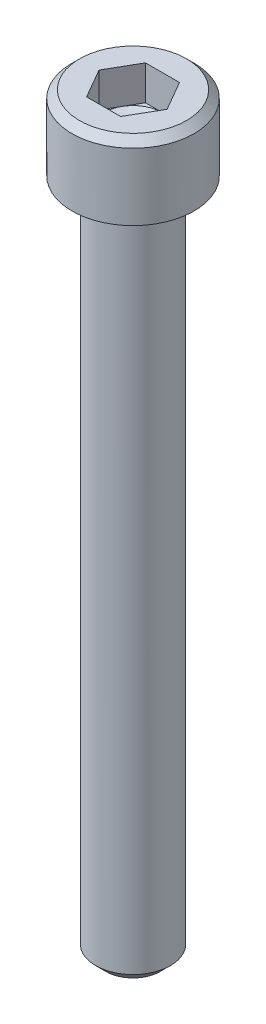
ISO-10303-21;
HEADER;
FILE_DESCRIPTION(('STEP AP214'),'2;1');
FILE_NAME('part.step','',(''),(''),'','','');
FILE_SCHEMA(('AUTOMOTIVE_DESIGN { 1 0 10303 214 1 1 1 1 }'));
ENDSEC;
DATA;
#1=APPLICATION_CONTEXT('core data for automotive mechanical design processes');
#2=APPLICATION_PROTOCOL_DEFINITION('international standard','automotive_design',2000,#1);
#3=PRODUCT_CONTEXT('',#1,'mechanical');
#4=PRODUCT('Part','Part','',(#3));
#5=PRODUCT_RELATED_PRODUCT_CATEGORY('part','',(#4));
#6=PRODUCT_DEFINITION_FORMATION('','',#4);
#7=PRODUCT_DEFINITION_CONTEXT('part definition',#1,'design');
#8=PRODUCT_DEFINITION('design','',#6,#7);
#9=PRODUCT_DEFINITION_SHAPE('','',#8);
#10=(LENGTH_UNIT() NAMED_UNIT(*) SI_UNIT(.MILLI.,.METRE.));
#11=(NAMED_UNIT(*) PLANE_ANGLE_UNIT() SI_UNIT($,.RADIAN.));
#12=(NAMED_UNIT(*) SI_UNIT($,.STERADIAN.) SOLID_ANGLE_UNIT());
#13=UNCERTAINTY_MEASURE_WITH_UNIT(LENGTH_MEASURE(1.E-05),#10,'distance_accuracy_value','');
#14=(GEOMETRIC_REPRESENTATION_CONTEXT(3) GLOBAL_UNCERTAINTY_ASSIGNED_CONTEXT((#13)) GLOBAL_UNIT_ASSIGNED_CONTEXT((#10,
#11,#12)) REPRESENTATION_CONTEXT('',''));
#15=CARTESIAN_POINT('',(0.,0.,0.));
#16=DIRECTION('',(0.,0.,1.));
#17=DIRECTION('',(1.,0.,0.));
#18=AXIS2_PLACEMENT_3D('',#15,#16,#17);
#19=CARTESIAN_POINT('',(0.,1.87959999988152,0.));
#20=DIRECTION('',(0.,1.,0.));
#21=DIRECTION('',(0.,0.,1.));
#22=AXIS2_PLACEMENT_3D('',#19,#20,#21);
#23=CONICAL_SURFACE('',#22,1.38429999981327,1.04719755105418);
#24=CARTESIAN_POINT('',(0.,1.08037402230821,-1.70530256582424E-10));
#25=VERTEX_POINT('',#24);
#26=VERTEX_LOOP('',#25);
#27=FACE_BOUND('',#26,.T.);
#28=CARTESIAN_POINT('',(0.,1.87959999997998,0.));
#29=DIRECTION('',(0.,1.,0.));
#30=DIRECTION('',(0.,0.,1.));
#31=AXIS2_PLACEMENT_3D('',#28,#29,#30);
#32=CIRCLE('',#31,1.3842999999838);
#33=CARTESIAN_POINT('',(-1.19883896645178,1.87959999998999,-0.692149999995953));
#34=VERTEX_POINT('',#33);
#35=CARTESIAN_POINT('',(0.,1.87959999998999,-1.3842999999919));
#36=VERTEX_POINT('',#35);
#37=EDGE_CURVE('E148',#34,#36,#32,.F.);
#38=ORIENTED_EDGE('',*,*,#37,.F.);
#39=CARTESIAN_POINT('',(0.,1.87959999997998,0.));
#40=DIRECTION('',(0.,1.,0.));
#41=DIRECTION('',(0.,0.,1.));
#42=AXIS2_PLACEMENT_3D('',#39,#40,#41);
#43=CIRCLE('',#42,1.3842999999838);
#44=CARTESIAN_POINT('',(-1.19883896645178,1.87959999998999,0.692149999995946));
#45=VERTEX_POINT('',#44);
#46=EDGE_CURVE('E95',#45,#34,#43,.F.);
#47=ORIENTED_EDGE('',*,*,#46,.F.);
#48=CARTESIAN_POINT('',(0.,1.87959999997998,0.));
#49=DIRECTION('',(0.,1.,0.));
#50=DIRECTION('',(0.,0.,1.));
#51=AXIS2_PLACEMENT_3D('',#48,#49,#50);
#52=CIRCLE('',#51,1.3842999999838);
#53=CARTESIAN_POINT('',(0.,1.87959999998999,1.3842999999919));
#54=VERTEX_POINT('',#53);
#55=EDGE_CURVE('E91',#54,#45,#52,.F.);
#56=ORIENTED_EDGE('',*,*,#55,.F.);
#57=CARTESIAN_POINT('',(0.,1.87959999997998,0.));
#58=DIRECTION('',(0.,1.,0.));
#59=DIRECTION('',(0.,0.,1.));
#60=AXIS2_PLACEMENT_3D('',#57,#58,#59);
#61=CIRCLE('',#60,1.3842999999838);
#62=CARTESIAN_POINT('',(1.19883896645178,1.87959999998999,0.692149999995948));
#63=VERTEX_POINT('',#62);
#64=EDGE_CURVE('E89',#63,#54,#61,.F.);
#65=ORIENTED_EDGE('',*,*,#64,.F.);
#66=CARTESIAN_POINT('',(0.,1.87959999997998,0.));
#67=DIRECTION('',(0.,1.,0.));
#68=DIRECTION('',(0.,0.,1.));
#69=AXIS2_PLACEMENT_3D('',#66,#67,#68);
#70=CIRCLE('',#69,1.3842999999838);
#71=CARTESIAN_POINT('',(1.19883896645178,1.87959999998999,-0.692149999995947));
#72=VERTEX_POINT('',#71);
#73=EDGE_CURVE('E19',#72,#63,#70,.F.);
#74=ORIENTED_EDGE('',*,*,#73,.F.);
#75=CARTESIAN_POINT('',(0.,1.87959999997998,0.));
#76=DIRECTION('',(0.,1.,0.));
#77=DIRECTION('',(0.,0.,1.));
#78=AXIS2_PLACEMENT_3D('',#75,#76,#77);
#79=CIRCLE('',#78,1.3842999999838);
#80=EDGE_CURVE('E106',#36,#72,#79,.F.);
#81=ORIENTED_EDGE('',*,*,#80,.F.);
#82=EDGE_LOOP('',(#38,#47,#56,#65,#74,#81));
#83=FACE_BOUND('',#82,.T.);
#84=ADVANCED_FACE('F16',(#27,#83),#23,.F.);
#85=CARTESIAN_POINT('',(0.,1.8796,0.));
#86=DIRECTION('',(0.,1.,0.));
#87=DIRECTION('',(0.,0.,1.));
#88=AXIS2_PLACEMENT_3D('',#85,#86,#87);
#89=PLANE('',#88);
#90=DIRECTION('',(0.500000000000001,0.,-0.866025403784438));
#91=VECTOR('',#90,1.);
#92=CARTESIAN_POINT('',(0.799225977639198,1.8796,1.3843));
#93=LINE('',#92,#91);
#94=CARTESIAN_POINT('',(1.5984519552784,1.8796,0.));
#95=VERTEX_POINT('',#94);
#96=EDGE_CURVE('E101',#63,#95,#93,.T.);
#97=ORIENTED_EDGE('',*,*,#96,.T.);
#98=DIRECTION('',(-0.499999999999999,0.,-0.866025403784439));
#99=VECTOR('',#98,1.);
#100=CARTESIAN_POINT('',(1.5984519552784,1.8796,0.));
#101=LINE('',#100,#99);
#102=EDGE_CURVE('E104',#95,#72,#101,.T.);
#103=ORIENTED_EDGE('',*,*,#102,.T.);
#104=ORIENTED_EDGE('',*,*,#73,.T.);
#105=EDGE_LOOP('',(#97,#103,#104));
#106=FACE_BOUND('',#105,.T.);
#107=ADVANCED_FACE('F99',(#106),#89,.T.);
#108=CARTESIAN_POINT('',(0.,1.8796,0.));
#109=DIRECTION('',(0.,1.,0.));
#110=DIRECTION('',(0.,0.,1.));
#111=AXIS2_PLACEMENT_3D('',#108,#109,#110);
#112=PLANE('',#111);
#113=DIRECTION('',(-0.499999999999999,0.,-0.866025403784439));
#114=VECTOR('',#113,1.);
#115=CARTESIAN_POINT('',(1.5984519552784,1.8796,0.));
#116=LINE('',#115,#114);
#117=CARTESIAN_POINT('',(0.799225977639201,1.8796,-1.3843));
#118=VERTEX_POINT('',#117);
#119=EDGE_CURVE('E115',#72,#118,#116,.T.);
#120=ORIENTED_EDGE('',*,*,#119,.T.);
#121=DIRECTION('',(-1.,0.,0.));
#122=VECTOR('',#121,1.);
#123=CARTESIAN_POINT('',(0.799225977639201,1.8796,-1.3843));
#124=LINE('',#123,#122);
#125=EDGE_CURVE('E155',#118,#36,#124,.T.);
#126=ORIENTED_EDGE('',*,*,#125,.T.);
#127=ORIENTED_EDGE('',*,*,#80,.T.);
#128=EDGE_LOOP('',(#120,#126,#127));
#129=FACE_BOUND('',#128,.T.);
#130=ADVANCED_FACE('F152',(#129),#112,.T.);
#131=CARTESIAN_POINT('',(0.,1.8796,0.));
#132=DIRECTION('',(0.,1.,0.));
#133=DIRECTION('',(0.,0.,1.));
#134=AXIS2_PLACEMENT_3D('',#131,#132,#133);
#135=PLANE('',#134);
#136=DIRECTION('',(-1.,0.,0.));
#137=VECTOR('',#136,1.);
#138=CARTESIAN_POINT('',(0.799225977639201,1.8796,-1.3843));
#139=LINE('',#138,#137);
#140=CARTESIAN_POINT('',(-0.799225977639195,1.8796,-1.3843));
#141=VERTEX_POINT('',#140);
#142=EDGE_CURVE('E160',#36,#141,#139,.T.);
#143=ORIENTED_EDGE('',*,*,#142,.T.);
#144=DIRECTION('',(-0.5,0.,0.866025403784438));
#145=VECTOR('',#144,1.);
#146=CARTESIAN_POINT('',(-0.799225977639195,1.8796,-1.3843));
#147=LINE('',#146,#145);
#148=EDGE_CURVE('E163',#141,#34,#147,.T.);
#149=ORIENTED_EDGE('',*,*,#148,.T.);
#150=ORIENTED_EDGE('',*,*,#37,.T.);
#151=EDGE_LOOP('',(#143,#149,#150));
#152=FACE_BOUND('',#151,.T.);
#153=ADVANCED_FACE('F159',(#152),#135,.T.);
#154=CARTESIAN_POINT('',(0.,1.8796,0.));
#155=DIRECTION('',(0.,1.,0.));
#156=DIRECTION('',(0.,0.,1.));
#157=AXIS2_PLACEMENT_3D('',#154,#155,#156);
#158=PLANE('',#157);
#159=DIRECTION('',(-0.5,0.,0.866025403784438));
#160=VECTOR('',#159,1.);
#161=CARTESIAN_POINT('',(-0.799225977639195,1.8796,-1.3843));
#162=LINE('',#161,#160);
#163=CARTESIAN_POINT('',(-1.5984519552784,1.8796,0.));
#164=VERTEX_POINT('',#163);
#165=EDGE_CURVE('E171',#34,#164,#162,.T.);
#166=ORIENTED_EDGE('',*,*,#165,.T.);
#167=DIRECTION('',(0.5,0.,0.866025403784439));
#168=VECTOR('',#167,1.);
#169=CARTESIAN_POINT('',(-1.5984519552784,1.8796,0.));
#170=LINE('',#169,#168);
#171=EDGE_CURVE('E230',#164,#45,#170,.T.);
#172=ORIENTED_EDGE('',*,*,#171,.T.);
#173=ORIENTED_EDGE('',*,*,#46,.T.);
#174=EDGE_LOOP('',(#166,#172,#173));
#175=FACE_BOUND('',#174,.T.);
#176=ADVANCED_FACE('F335',(#175),#158,.T.);
#177=CARTESIAN_POINT('',(0.,1.8796,0.));
#178=DIRECTION('',(0.,1.,0.));
#179=DIRECTION('',(0.,0.,1.));
#180=AXIS2_PLACEMENT_3D('',#177,#178,#179);
#181=PLANE('',#180);
#182=DIRECTION('',(1.,0.,0.));
#183=VECTOR('',#182,1.);
#184=CARTESIAN_POINT('',(-0.799225977639198,1.8796,1.3843));
#185=LINE('',#184,#183);
#186=CARTESIAN_POINT('',(0.799225977639198,1.8796,1.3843));
#187=VERTEX_POINT('',#186);
#188=EDGE_CURVE('E111',#54,#187,#185,.T.);
#189=ORIENTED_EDGE('',*,*,#188,.T.);
#190=DIRECTION('',(0.500000000000001,0.,-0.866025403784438));
#191=VECTOR('',#190,1.);
#192=CARTESIAN_POINT('',(0.799225977639198,1.8796,1.3843));
#193=LINE('',#192,#191);
#194=EDGE_CURVE('E108',#187,#63,#193,.T.);
#195=ORIENTED_EDGE('',*,*,#194,.T.);
#196=ORIENTED_EDGE('',*,*,#64,.T.);
#197=EDGE_LOOP('',(#189,#195,#196));
#198=FACE_BOUND('',#197,.T.);
#199=ADVANCED_FACE('F109',(#198),#181,.T.);
#200=CARTESIAN_POINT('',(0.,1.8796,0.));
#201=DIRECTION('',(0.,1.,0.));
#202=DIRECTION('',(0.,0.,1.));
#203=AXIS2_PLACEMENT_3D('',#200,#201,#202);
#204=PLANE('',#203);
#205=DIRECTION('',(0.5,0.,0.866025403784439));
#206=VECTOR('',#205,1.);
#207=CARTESIAN_POINT('',(-1.5984519552784,1.8796,0.));
#208=LINE('',#207,#206);
#209=CARTESIAN_POINT('',(-0.799225977639199,1.8796,1.3843));
#210=VERTEX_POINT('',#209);
#211=EDGE_CURVE('E167',#45,#210,#208,.T.);
#212=ORIENTED_EDGE('',*,*,#211,.T.);
#213=DIRECTION('',(1.,0.,0.));
#214=VECTOR('',#213,1.);
#215=CARTESIAN_POINT('',(-0.799225977639198,1.8796,1.3843));
#216=LINE('',#215,#214);
#217=EDGE_CURVE('E131',#210,#54,#216,.T.);
#218=ORIENTED_EDGE('',*,*,#217,.T.);
#219=ORIENTED_EDGE('',*,*,#55,.T.);
#220=EDGE_LOOP('',(#212,#218,#219));
#221=FACE_BOUND('',#220,.T.);
#222=ADVANCED_FACE('F329',(#221),#204,.T.);
#223=CARTESIAN_POINT('',(0.799225977639198,3.5052,1.3843));
#224=DIRECTION('',(0.866025403784438,0.,0.500000000000001));
#225=DIRECTION('',(0.500000000000001,0.,-0.866025403784438));
#226=AXIS2_PLACEMENT_3D('',#223,#224,#225);
#227=PLANE('',#226);
#228=DIRECTION('',(0.,1.,0.));
#229=VECTOR('',#228,1.);
#230=CARTESIAN_POINT('',(0.799225977639198,3.5052,1.3843));
#231=LINE('',#230,#229);
#232=CARTESIAN_POINT('',(0.799225977639198,3.5052,1.3843));
#233=VERTEX_POINT('',#232);
#234=EDGE_CURVE('E238',#187,#233,#231,.T.);
#235=ORIENTED_EDGE('',*,*,#234,.T.);
#236=DIRECTION('',(0.500000000000002,0.,-0.866025403784437));
#237=VECTOR('',#236,1.);
#238=CARTESIAN_POINT('',(0.799225977639198,3.5052,1.3843));
#239=LINE('',#238,#237);
#240=CARTESIAN_POINT('',(1.5984519552784,3.5052,0.));
#241=VERTEX_POINT('',#240);
#242=EDGE_CURVE('E128',#233,#241,#239,.T.);
#243=ORIENTED_EDGE('',*,*,#242,.T.);
#244=DIRECTION('',(0.,1.,0.));
#245=VECTOR('',#244,1.);
#246=CARTESIAN_POINT('',(1.5984519552784,3.5052,0.));
#247=LINE('',#246,#245);
#248=EDGE_CURVE('E119',#241,#95,#247,.F.);
#249=ORIENTED_EDGE('',*,*,#248,.T.);
#250=ORIENTED_EDGE('',*,*,#96,.F.);
#251=ORIENTED_EDGE('',*,*,#194,.F.);
#252=EDGE_LOOP('',(#235,#243,#249,#250,#251));
#253=FACE_BOUND('',#252,.T.);
#254=ADVANCED_FACE('F117',(#253),#227,.F.);
#255=CARTESIAN_POINT('',(1.5984519552784,3.5052,0.));
#256=DIRECTION('',(0.866025403784439,0.,-0.499999999999999));
#257=DIRECTION('',(-0.499999999999999,0.,-0.866025403784439));
#258=AXIS2_PLACEMENT_3D('',#255,#256,#257);
#259=PLANE('',#258);
#260=ORIENTED_EDGE('',*,*,#248,.F.);
#261=DIRECTION('',(-0.5,0.,-0.866025403784439));
#262=VECTOR('',#261,1.);
#263=CARTESIAN_POINT('',(1.5984519552784,3.5052,0.));
#264=LINE('',#263,#262);
#265=CARTESIAN_POINT('',(0.799225977639201,3.5052,-1.3843));
#266=VERTEX_POINT('',#265);
#267=EDGE_CURVE('E130',#241,#266,#264,.T.);
#268=ORIENTED_EDGE('',*,*,#267,.T.);
#269=DIRECTION('',(0.,1.,0.));
#270=VECTOR('',#269,1.);
#271=CARTESIAN_POINT('',(0.799225977639201,3.5052,-1.3843));
#272=LINE('',#271,#270);
#273=EDGE_CURVE('E179',#266,#118,#272,.F.);
#274=ORIENTED_EDGE('',*,*,#273,.T.);
#275=ORIENTED_EDGE('',*,*,#119,.F.);
#276=ORIENTED_EDGE('',*,*,#102,.F.);
#277=EDGE_LOOP('',(#260,#268,#274,#275,#276));
#278=FACE_BOUND('',#277,.T.);
#279=ADVANCED_FACE('F218',(#278),#259,.F.);
#280=CARTESIAN_POINT('',(0.799225977639201,3.5052,-1.3843));
#281=DIRECTION('',(0.,0.,-1.));
#282=DIRECTION('',(-1.,0.,0.));
#283=AXIS2_PLACEMENT_3D('',#280,#281,#282);
#284=PLANE('',#283);
#285=ORIENTED_EDGE('',*,*,#273,.F.);
#286=DIRECTION('',(1.,0.,0.));
#287=VECTOR('',#286,1.);
#288=CARTESIAN_POINT('',(0.,3.5052,-1.3843));
#289=LINE('',#288,#287);
#290=CARTESIAN_POINT('',(-0.799225977639195,3.5052,-1.3843));
#291=VERTEX_POINT('',#290);
#292=EDGE_CURVE('E189',#266,#291,#289,.F.);
#293=ORIENTED_EDGE('',*,*,#292,.T.);
#294=DIRECTION('',(0.,1.,0.));
#295=VECTOR('',#294,1.);
#296=CARTESIAN_POINT('',(-0.799225977639195,3.5052,-1.3843));
#297=LINE('',#296,#295);
#298=EDGE_CURVE('E168',#291,#141,#297,.F.);
#299=ORIENTED_EDGE('',*,*,#298,.T.);
#300=ORIENTED_EDGE('',*,*,#142,.F.);
#301=ORIENTED_EDGE('',*,*,#125,.F.);
#302=EDGE_LOOP('',(#285,#293,#299,#300,#301));
#303=FACE_BOUND('',#302,.T.);
#304=ADVANCED_FACE('F223',(#303),#284,.F.);
#305=CARTESIAN_POINT('',(-0.799225977639195,3.5052,-1.3843));
#306=DIRECTION('',(-0.866025403784438,0.,-0.5));
#307=DIRECTION('',(-0.5,0.,0.866025403784438));
#308=AXIS2_PLACEMENT_3D('',#305,#306,#307);
#309=PLANE('',#308);
#310=ORIENTED_EDGE('',*,*,#298,.F.);
#311=DIRECTION('',(-0.500000000000003,0.,0.866025403784437));
#312=VECTOR('',#311,1.);
#313=CARTESIAN_POINT('',(-0.799225977639195,3.5052,-1.3843));
#314=LINE('',#313,#312);
#315=CARTESIAN_POINT('',(-1.5984519552784,3.5052,0.));
#316=VERTEX_POINT('',#315);
#317=EDGE_CURVE('E187',#291,#316,#314,.T.);
#318=ORIENTED_EDGE('',*,*,#317,.T.);
#319=DIRECTION('',(0.,1.,0.));
#320=VECTOR('',#319,1.);
#321=CARTESIAN_POINT('',(-1.5984519552784,3.5052,0.));
#322=LINE('',#321,#320);
#323=EDGE_CURVE('E173',#316,#164,#322,.F.);
#324=ORIENTED_EDGE('',*,*,#323,.T.);
#325=ORIENTED_EDGE('',*,*,#165,.F.);
#326=ORIENTED_EDGE('',*,*,#148,.F.);
#327=EDGE_LOOP('',(#310,#318,#324,#325,#326));
#328=FACE_BOUND('',#327,.T.);
#329=ADVANCED_FACE('F172',(#328),#309,.F.);
#330=CARTESIAN_POINT('',(-1.5984519552784,3.5052,0.));
#331=DIRECTION('',(-0.866025403784439,0.,0.5));
#332=DIRECTION('',(0.5,0.,0.866025403784439));
#333=AXIS2_PLACEMENT_3D('',#330,#331,#332);
#334=PLANE('',#333);
#335=ORIENTED_EDGE('',*,*,#323,.F.);
#336=DIRECTION('',(0.500000000000001,0.,0.866025403784438));
#337=VECTOR('',#336,1.);
#338=CARTESIAN_POINT('',(-1.5984519552784,3.5052,0.));
#339=LINE('',#338,#337);
#340=CARTESIAN_POINT('',(-0.799225977639198,3.5052,1.3843));
#341=VERTEX_POINT('',#340);
#342=EDGE_CURVE('E34',#316,#341,#339,.T.);
#343=ORIENTED_EDGE('',*,*,#342,.T.);
#344=DIRECTION('',(0.,1.,0.));
#345=VECTOR('',#344,1.);
#346=CARTESIAN_POINT('',(-0.799225977639198,3.5052,1.3843));
#347=LINE('',#346,#345);
#348=EDGE_CURVE('E240',#341,#210,#347,.F.);
#349=ORIENTED_EDGE('',*,*,#348,.T.);
#350=ORIENTED_EDGE('',*,*,#211,.F.);
#351=ORIENTED_EDGE('',*,*,#171,.F.);
#352=EDGE_LOOP('',(#335,#343,#349,#350,#351));
#353=FACE_BOUND('',#352,.T.);
#354=ADVANCED_FACE('F228',(#353),#334,.F.);
#355=CARTESIAN_POINT('',(-0.799225977639198,3.5052,1.3843));
#356=DIRECTION('',(0.,0.,1.));
#357=DIRECTION('',(1.,0.,0.));
#358=AXIS2_PLACEMENT_3D('',#355,#356,#357);
#359=PLANE('',#358);
#360=ORIENTED_EDGE('',*,*,#348,.F.);
#361=DIRECTION('',(1.,0.,0.));
#362=VECTOR('',#361,1.);
#363=CARTESIAN_POINT('',(0.,3.5052,1.3843));
#364=LINE('',#363,#362);
#365=EDGE_CURVE('E144',#341,#233,#364,.T.);
#366=ORIENTED_EDGE('',*,*,#365,.T.);
#367=ORIENTED_EDGE('',*,*,#234,.F.);
#368=ORIENTED_EDGE('',*,*,#188,.F.);
#369=ORIENTED_EDGE('',*,*,#217,.F.);
#370=EDGE_LOOP('',(#360,#366,#367,#368,#369));
#371=FACE_BOUND('',#370,.T.);
#372=ADVANCED_FACE('F315',(#371),#359,.F.);
#373=CARTESIAN_POINT('',(0.,3.5052,0.));
#374=DIRECTION('',(0.,-1.,0.));
#375=DIRECTION('',(0.,0.,-1.));
#376=AXIS2_PLACEMENT_3D('',#373,#374,#375);
#377=PLANE('',#376);
#378=ORIENTED_EDGE('',*,*,#342,.F.);
#379=ORIENTED_EDGE('',*,*,#317,.F.);
#380=ORIENTED_EDGE('',*,*,#292,.F.);
#381=ORIENTED_EDGE('',*,*,#267,.F.);
#382=ORIENTED_EDGE('',*,*,#242,.F.);
#383=ORIENTED_EDGE('',*,*,#365,.F.);
#384=EDGE_LOOP('',(#378,#379,#380,#381,#382,#383));
#385=FACE_BOUND('',#384,.T.);
#386=CARTESIAN_POINT('',(0.,3.50519999989274,0.));
#387=DIRECTION('',(0.,-1.,0.));
#388=DIRECTION('',(1.,0.,0.));
#389=AXIS2_PLACEMENT_3D('',#386,#387,#388);
#390=CIRCLE('',#389,2.51460000004045);
#391=CARTESIAN_POINT('',(2.51460000004045,3.50519999989274,0.));
#392=VERTEX_POINT('',#391);
#393=EDGE_CURVE('E142',#392,#392,#390,.T.);
#394=ORIENTED_EDGE('',*,*,#393,.F.);
#395=EDGE_LOOP('',(#394));
#396=FACE_BOUND('',#395,.T.);
#397=ADVANCED_FACE('F225',(#385,#396),#377,.F.);
#398=CARTESIAN_POINT('',(0.,3.149599999972,0.));
#399=DIRECTION('',(0.,-1.,0.));
#400=DIRECTION('',(1.,0.,0.));
#401=AXIS2_PLACEMENT_3D('',#398,#399,#400);
#402=CONICAL_SURFACE('',#401,2.87020000001803,0.785398163477374);
#403=CARTESIAN_POINT('',(0.,3.1496,0.));
#404=DIRECTION('',(0.,-1.,0.));
#405=DIRECTION('',(0.,0.,-1.));
#406=AXIS2_PLACEMENT_3D('',#403,#404,#405);
#407=CIRCLE('',#406,2.8702);
#408=CARTESIAN_POINT('',(0.,3.1496,-2.8702));
#409=VERTEX_POINT('',#408);
#410=EDGE_CURVE('E141',#409,#409,#407,.T.);
#411=ORIENTED_EDGE('',*,*,#410,.F.);
#412=EDGE_LOOP('',(#411));
#413=FACE_BOUND('',#412,.T.);
#414=ORIENTED_EDGE('',*,*,#393,.T.);
#415=EDGE_LOOP('',(#414));
#416=FACE_BOUND('',#415,.T.);
#417=ADVANCED_FACE('F308',(#413,#416),#402,.T.);
#418=CARTESIAN_POINT('',(0.,5.26796,0.));
#419=DIRECTION('',(0.,-1.,0.));
#420=DIRECTION('',(0.,0.,-1.));
#421=AXIS2_PLACEMENT_3D('',#418,#419,#420);
#422=CYLINDRICAL_SURFACE('',#421,2.8702);
#423=CARTESIAN_POINT('',(0.,0.,0.));
#424=DIRECTION('',(0.,-1.,0.));
#425=DIRECTION('',(0.,0.,-1.));
#426=AXIS2_PLACEMENT_3D('',#423,#424,#425);
#427=CIRCLE('',#426,2.8702);
#428=CARTESIAN_POINT('',(0.,0.,-2.8702));
#429=VERTEX_POINT('',#428);
#430=EDGE_CURVE('E138',#429,#429,#427,.T.);
#431=ORIENTED_EDGE('',*,*,#430,.F.);
#432=EDGE_LOOP('',(#431));
#433=FACE_BOUND('',#432,.T.);
#434=ORIENTED_EDGE('',*,*,#410,.T.);
#435=EDGE_LOOP('',(#434));
#436=FACE_BOUND('',#435,.T.);
#437=ADVANCED_FACE('F305',(#433,#436),#422,.T.);
#438=CARTESIAN_POINT('',(0.,0.,0.));
#439=DIRECTION('',(0.,-1.,0.));
#440=DIRECTION('',(0.,0.,-1.));
#441=AXIS2_PLACEMENT_3D('',#438,#439,#440);
#442=PLANE('',#441);
#443=CARTESIAN_POINT('',(0.,0.,0.));
#444=DIRECTION('',(0.,-1.,0.));
#445=DIRECTION('',(-1.,0.,-2.63360828039282E-11));
#446=AXIS2_PLACEMENT_3D('',#443,#444,#445);
#447=CIRCLE('',#446,2.0066);
#448=CARTESIAN_POINT('',(-2.0066,0.,-5.28459837543624E-11));
#449=VERTEX_POINT('',#448);
#450=EDGE_CURVE('E137',#449,#449,#447,.F.);
#451=ORIENTED_EDGE('',*,*,#450,.T.);
#452=EDGE_LOOP('',(#451));
#453=FACE_BOUND('',#452,.T.);
#454=ORIENTED_EDGE('',*,*,#430,.T.);
#455=EDGE_LOOP('',(#454));
#456=FACE_BOUND('',#455,.T.);
#457=ADVANCED_FACE('F296',(#453,#456),#442,.T.);
#458=CARTESIAN_POINT('',(0.,-31.75,0.));
#459=DIRECTION('',(0.,-1.,0.));
#460=DIRECTION('',(0.,0.,-1.));
#461=AXIS2_PLACEMENT_3D('',#458,#459,#460);
#462=PLANE('',#461);
#463=CARTESIAN_POINT('',(0.,-31.7499999999313,0.));
#464=DIRECTION('',(0.,1.,0.));
#465=DIRECTION('',(0.,0.,1.));
#466=AXIS2_PLACEMENT_3D('',#463,#464,#465);
#467=CIRCLE('',#466,1.28015999996478);
#468=CARTESIAN_POINT('',(0.,-31.7499999999313,1.28015999996478));
#469=VERTEX_POINT('',#468);
#470=EDGE_CURVE('E134',#469,#469,#467,.T.);
#471=ORIENTED_EDGE('',*,*,#470,.F.);
#472=EDGE_LOOP('',(#471));
#473=FACE_BOUND('',#472,.T.);
#474=ADVANCED_FACE('F283',(#473),#462,.T.);
#475=CARTESIAN_POINT('',(0.,-0.254,0.));
#476=DIRECTION('',(0.,-1.,0.));
#477=DIRECTION('',(0.,0.,-1.));
#478=AXIS2_PLACEMENT_3D('',#475,#476,#477);
#479=TOROIDAL_SURFACE('',#478,2.0066,0.254);
#480=CARTESIAN_POINT('',(0.,-0.254,0.));
#481=DIRECTION('',(0.,-1.,0.));
#482=DIRECTION('',(0.,0.,-1.));
#483=AXIS2_PLACEMENT_3D('',#480,#481,#482);
#484=CIRCLE('',#483,1.7526);
#485=CARTESIAN_POINT('',(0.,-0.254,-1.7526));
#486=VERTEX_POINT('',#485);
#487=EDGE_CURVE('E25',#486,#486,#484,.T.);
#488=ORIENTED_EDGE('',*,*,#487,.F.);
#489=EDGE_LOOP('',(#488));
#490=FACE_BOUND('',#489,.T.);
#491=ORIENTED_EDGE('',*,*,#450,.F.);
#492=EDGE_LOOP('',(#491));
#493=FACE_BOUND('',#492,.T.);
#494=ADVANCED_FACE('F271',(#490,#493),#479,.F.);
#495=CARTESIAN_POINT('',(0.,-31.2775599999782,0.));
#496=DIRECTION('',(0.,1.,0.));
#497=DIRECTION('',(0.,0.,1.));
#498=AXIS2_PLACEMENT_3D('',#495,#496,#497);
#499=CONICAL_SURFACE('',#498,1.75259999991795,0.785398163397448);
#500=ORIENTED_EDGE('',*,*,#470,.T.);
#501=EDGE_LOOP('',(#500));
#502=FACE_BOUND('',#501,.T.);
#503=CARTESIAN_POINT('',(0.,-31.27756,0.));
#504=DIRECTION('',(0.,-1.,0.));
#505=DIRECTION('',(0.,0.,-1.));
#506=AXIS2_PLACEMENT_3D('',#503,#504,#505);
#507=CIRCLE('',#506,1.7526);
#508=CARTESIAN_POINT('',(0.,-31.27756,-1.7526));
#509=VERTEX_POINT('',#508);
#510=EDGE_CURVE('E11',#509,#509,#507,.F.);
#511=ORIENTED_EDGE('',*,*,#510,.F.);
#512=EDGE_LOOP('',(#511));
#513=FACE_BOUND('',#512,.T.);
#514=ADVANCED_FACE('F282',(#502,#513),#499,.T.);
#515=CARTESIAN_POINT('',(0.,5.26796,0.));
#516=DIRECTION('',(0.,-1.,0.));
#517=DIRECTION('',(0.,0.,-1.));
#518=AXIS2_PLACEMENT_3D('',#515,#516,#517);
#519=CYLINDRICAL_SURFACE('',#518,1.7526);
#520=ORIENTED_EDGE('',*,*,#510,.T.);
#521=EDGE_LOOP('',(#520));
#522=FACE_BOUND('',#521,.T.);
#523=ORIENTED_EDGE('',*,*,#487,.T.);
#524=EDGE_LOOP('',(#523));
#525=FACE_BOUND('',#524,.T.);
#526=ADVANCED_FACE('F347',(#522,#525),#519,.T.);
#527=CLOSED_SHELL('',(#84,#107,#130,#153,#176,#199,#222,#254,#279,#304,#329,#354,#372,#397,#417,
#437,#457,#474,#494,#514,#526));
#528=MANIFOLD_SOLID_BREP('B1',#527);
#529=ADVANCED_BREP_SHAPE_REPRESENTATION('',(#18,#528),#14);
#530=SHAPE_DEFINITION_REPRESENTATION(#9,#529);
ENDSEC;
END-ISO-10303-21;
